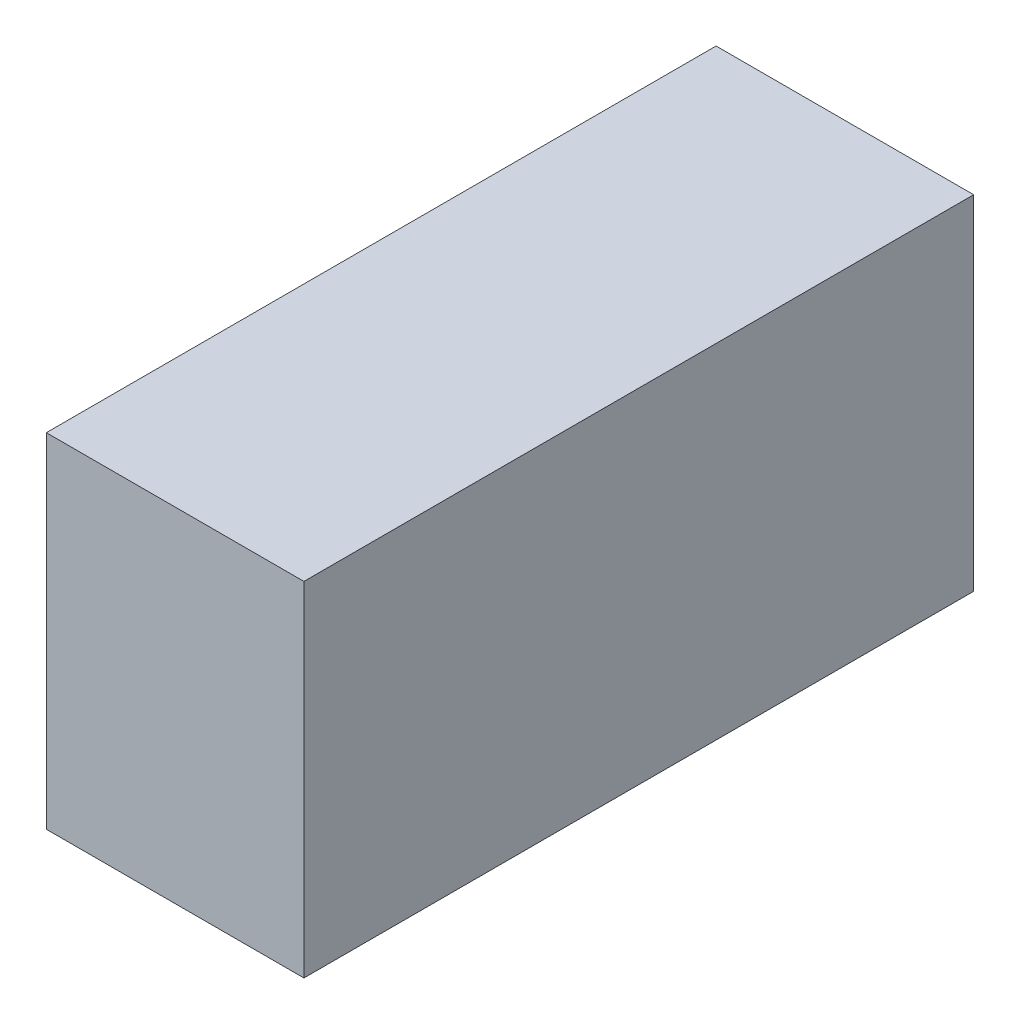
ISO-10303-21;
HEADER;
FILE_DESCRIPTION(('STEP AP214'),'2;1');
FILE_NAME('part.step','',(''),(''),'','','');
FILE_SCHEMA(('AUTOMOTIVE_DESIGN { 1 0 10303 214 1 1 1 1 }'));
ENDSEC;
DATA;
#1=APPLICATION_CONTEXT('core data for automotive mechanical design processes');
#2=APPLICATION_PROTOCOL_DEFINITION('international standard','automotive_design',2000,#1);
#3=PRODUCT_CONTEXT('',#1,'mechanical');
#4=PRODUCT('Part','Part','',(#3));
#5=PRODUCT_RELATED_PRODUCT_CATEGORY('part','',(#4));
#6=PRODUCT_DEFINITION_FORMATION('','',#4);
#7=PRODUCT_DEFINITION_CONTEXT('part definition',#1,'design');
#8=PRODUCT_DEFINITION('design','',#6,#7);
#9=PRODUCT_DEFINITION_SHAPE('','',#8);
#10=(LENGTH_UNIT() NAMED_UNIT(*) SI_UNIT(.MILLI.,.METRE.));
#11=(NAMED_UNIT(*) PLANE_ANGLE_UNIT() SI_UNIT($,.RADIAN.));
#12=(NAMED_UNIT(*) SI_UNIT($,.STERADIAN.) SOLID_ANGLE_UNIT());
#13=UNCERTAINTY_MEASURE_WITH_UNIT(LENGTH_MEASURE(1.E-05),#10,'distance_accuracy_value','');
#14=(GEOMETRIC_REPRESENTATION_CONTEXT(3) GLOBAL_UNCERTAINTY_ASSIGNED_CONTEXT((#13)) GLOBAL_UNIT_ASSIGNED_CONTEXT((#10,
#11,#12)) REPRESENTATION_CONTEXT('',''));
#15=CARTESIAN_POINT('',(0.,0.,0.));
#16=DIRECTION('',(0.,0.,1.));
#17=DIRECTION('',(1.,0.,0.));
#18=AXIS2_PLACEMENT_3D('',#15,#16,#17);
#19=CARTESIAN_POINT('',(-4.7625,6.35,12.3825));
#20=DIRECTION('',(1.,0.,0.));
#21=DIRECTION('',(0.,1.,0.));
#22=AXIS2_PLACEMENT_3D('',#19,#20,#21);
#23=PLANE('',#22);
#24=DIRECTION('',(0.,0.,-1.));
#25=VECTOR('',#24,1.);
#26=CARTESIAN_POINT('',(-4.7625,6.35,12.3825));
#27=LINE('',#26,#25);
#28=CARTESIAN_POINT('',(-4.7625,6.35,12.3825));
#29=VERTEX_POINT('',#28);
#30=CARTESIAN_POINT('',(-4.7625,6.35,-12.3825));
#31=VERTEX_POINT('',#30);
#32=EDGE_CURVE('E90',#29,#31,#27,.T.);
#33=ORIENTED_EDGE('',*,*,#32,.T.);
#34=DIRECTION('',(0.,-1.,0.));
#35=VECTOR('',#34,1.);
#36=CARTESIAN_POINT('',(-4.7625,6.35,-12.3825));
#37=LINE('',#36,#35);
#38=CARTESIAN_POINT('',(-4.7625,-6.35,-12.3825));
#39=VERTEX_POINT('',#38);
#40=EDGE_CURVE('E85',#31,#39,#37,.T.);
#41=ORIENTED_EDGE('',*,*,#40,.T.);
#42=DIRECTION('',(0.,0.,-1.));
#43=VECTOR('',#42,1.);
#44=CARTESIAN_POINT('',(-4.7625,-6.35,12.3825));
#45=LINE('',#44,#43);
#46=CARTESIAN_POINT('',(-4.7625,-6.35,12.3825));
#47=VERTEX_POINT('',#46);
#48=EDGE_CURVE('E11',#47,#39,#45,.T.);
#49=ORIENTED_EDGE('',*,*,#48,.F.);
#50=DIRECTION('',(0.,-1.,0.));
#51=VECTOR('',#50,1.);
#52=CARTESIAN_POINT('',(-4.7625,6.35,12.3825));
#53=LINE('',#52,#51);
#54=EDGE_CURVE('E96',#29,#47,#53,.T.);
#55=ORIENTED_EDGE('',*,*,#54,.F.);
#56=EDGE_LOOP('',(#33,#41,#49,#55));
#57=FACE_BOUND('',#56,.T.);
#58=ADVANCED_FACE('F33',(#57),#23,.F.);
#59=CARTESIAN_POINT('',(-4.7625,-6.35,12.3825));
#60=DIRECTION('',(0.,1.,0.));
#61=DIRECTION('',(0.,0.,1.));
#62=AXIS2_PLACEMENT_3D('',#59,#60,#61);
#63=PLANE('',#62);
#64=ORIENTED_EDGE('',*,*,#48,.T.);
#65=DIRECTION('',(1.,0.,0.));
#66=VECTOR('',#65,1.);
#67=CARTESIAN_POINT('',(-4.7625,-6.35,-12.3825));
#68=LINE('',#67,#66);
#69=CARTESIAN_POINT('',(4.7625,-6.35,-12.3825));
#70=VERTEX_POINT('',#69);
#71=EDGE_CURVE('E75',#39,#70,#68,.T.);
#72=ORIENTED_EDGE('',*,*,#71,.T.);
#73=DIRECTION('',(0.,0.,-1.));
#74=VECTOR('',#73,1.);
#75=CARTESIAN_POINT('',(4.7625,-6.35,12.3825));
#76=LINE('',#75,#74);
#77=CARTESIAN_POINT('',(4.7625,-6.35,12.3825));
#78=VERTEX_POINT('',#77);
#79=EDGE_CURVE('E40',#78,#70,#76,.T.);
#80=ORIENTED_EDGE('',*,*,#79,.F.);
#81=DIRECTION('',(1.,0.,0.));
#82=VECTOR('',#81,1.);
#83=CARTESIAN_POINT('',(-4.7625,-6.35,12.3825));
#84=LINE('',#83,#82);
#85=EDGE_CURVE('E76',#47,#78,#84,.T.);
#86=ORIENTED_EDGE('',*,*,#85,.F.);
#87=EDGE_LOOP('',(#64,#72,#80,#86));
#88=FACE_BOUND('',#87,.T.);
#89=ADVANCED_FACE('F73',(#88),#63,.F.);
#90=CARTESIAN_POINT('',(4.7625,6.35,12.3825));
#91=DIRECTION('',(-1.,0.,0.));
#92=DIRECTION('',(0.,-1.,0.));
#93=AXIS2_PLACEMENT_3D('',#90,#91,#92);
#94=PLANE('',#93);
#95=ORIENTED_EDGE('',*,*,#79,.T.);
#96=DIRECTION('',(0.,1.,0.));
#97=VECTOR('',#96,1.);
#98=CARTESIAN_POINT('',(4.7625,6.35,-12.3825));
#99=LINE('',#98,#97);
#100=CARTESIAN_POINT('',(4.7625,6.35,-12.3825));
#101=VERTEX_POINT('',#100);
#102=EDGE_CURVE('E88',#70,#101,#99,.T.);
#103=ORIENTED_EDGE('',*,*,#102,.T.);
#104=DIRECTION('',(0.,0.,-1.));
#105=VECTOR('',#104,1.);
#106=CARTESIAN_POINT('',(4.7625,6.35,12.3825));
#107=LINE('',#106,#105);
#108=CARTESIAN_POINT('',(4.7625,6.35,12.3825));
#109=VERTEX_POINT('',#108);
#110=EDGE_CURVE('E102',#109,#101,#107,.T.);
#111=ORIENTED_EDGE('',*,*,#110,.F.);
#112=DIRECTION('',(0.,1.,0.));
#113=VECTOR('',#112,1.);
#114=CARTESIAN_POINT('',(4.7625,6.35,12.3825));
#115=LINE('',#114,#113);
#116=EDGE_CURVE('E52',#78,#109,#115,.T.);
#117=ORIENTED_EDGE('',*,*,#116,.F.);
#118=EDGE_LOOP('',(#95,#103,#111,#117));
#119=FACE_BOUND('',#118,.T.);
#120=ADVANCED_FACE('F104',(#119),#94,.F.);
#121=CARTESIAN_POINT('',(-4.7625,6.35,12.3825));
#122=DIRECTION('',(0.,-1.,0.));
#123=DIRECTION('',(1.,0.,0.));
#124=AXIS2_PLACEMENT_3D('',#121,#122,#123);
#125=PLANE('',#124);
#126=ORIENTED_EDGE('',*,*,#110,.T.);
#127=DIRECTION('',(-1.,0.,0.));
#128=VECTOR('',#127,1.);
#129=CARTESIAN_POINT('',(-4.7625,6.35,-12.3825));
#130=LINE('',#129,#128);
#131=EDGE_CURVE('E94',#101,#31,#130,.T.);
#132=ORIENTED_EDGE('',*,*,#131,.T.);
#133=ORIENTED_EDGE('',*,*,#32,.F.);
#134=DIRECTION('',(-1.,0.,0.));
#135=VECTOR('',#134,1.);
#136=CARTESIAN_POINT('',(-4.7625,6.35,12.3825));
#137=LINE('',#136,#135);
#138=EDGE_CURVE('E47',#109,#29,#137,.T.);
#139=ORIENTED_EDGE('',*,*,#138,.F.);
#140=EDGE_LOOP('',(#126,#132,#133,#139));
#141=FACE_BOUND('',#140,.T.);
#142=ADVANCED_FACE('F106',(#141),#125,.F.);
#143=CARTESIAN_POINT('',(0.,0.,12.3825));
#144=DIRECTION('',(0.,0.,1.));
#145=DIRECTION('',(1.,0.,0.));
#146=AXIS2_PLACEMENT_3D('',#143,#144,#145);
#147=PLANE('',#146);
#148=ORIENTED_EDGE('',*,*,#54,.T.);
#149=ORIENTED_EDGE('',*,*,#85,.T.);
#150=ORIENTED_EDGE('',*,*,#116,.T.);
#151=ORIENTED_EDGE('',*,*,#138,.T.);
#152=EDGE_LOOP('',(#148,#149,#150,#151));
#153=FACE_BOUND('',#152,.T.);
#154=ADVANCED_FACE('F107',(#153),#147,.T.);
#155=CARTESIAN_POINT('',(0.,0.,-12.3825));
#156=DIRECTION('',(0.,0.,1.));
#157=DIRECTION('',(1.,0.,0.));
#158=AXIS2_PLACEMENT_3D('',#155,#156,#157);
#159=PLANE('',#158);
#160=ORIENTED_EDGE('',*,*,#40,.F.);
#161=ORIENTED_EDGE('',*,*,#131,.F.);
#162=ORIENTED_EDGE('',*,*,#102,.F.);
#163=ORIENTED_EDGE('',*,*,#71,.F.);
#164=EDGE_LOOP('',(#160,#161,#162,#163));
#165=FACE_BOUND('',#164,.T.);
#166=ADVANCED_FACE('F83',(#165),#159,.F.);
#167=CLOSED_SHELL('',(#58,#89,#120,#142,#154,#166));
#168=MANIFOLD_SOLID_BREP('B2',#167);
#169=ADVANCED_BREP_SHAPE_REPRESENTATION('',(#18,#168),#14);
#170=SHAPE_DEFINITION_REPRESENTATION(#9,#169);
ENDSEC;
END-ISO-10303-21;
